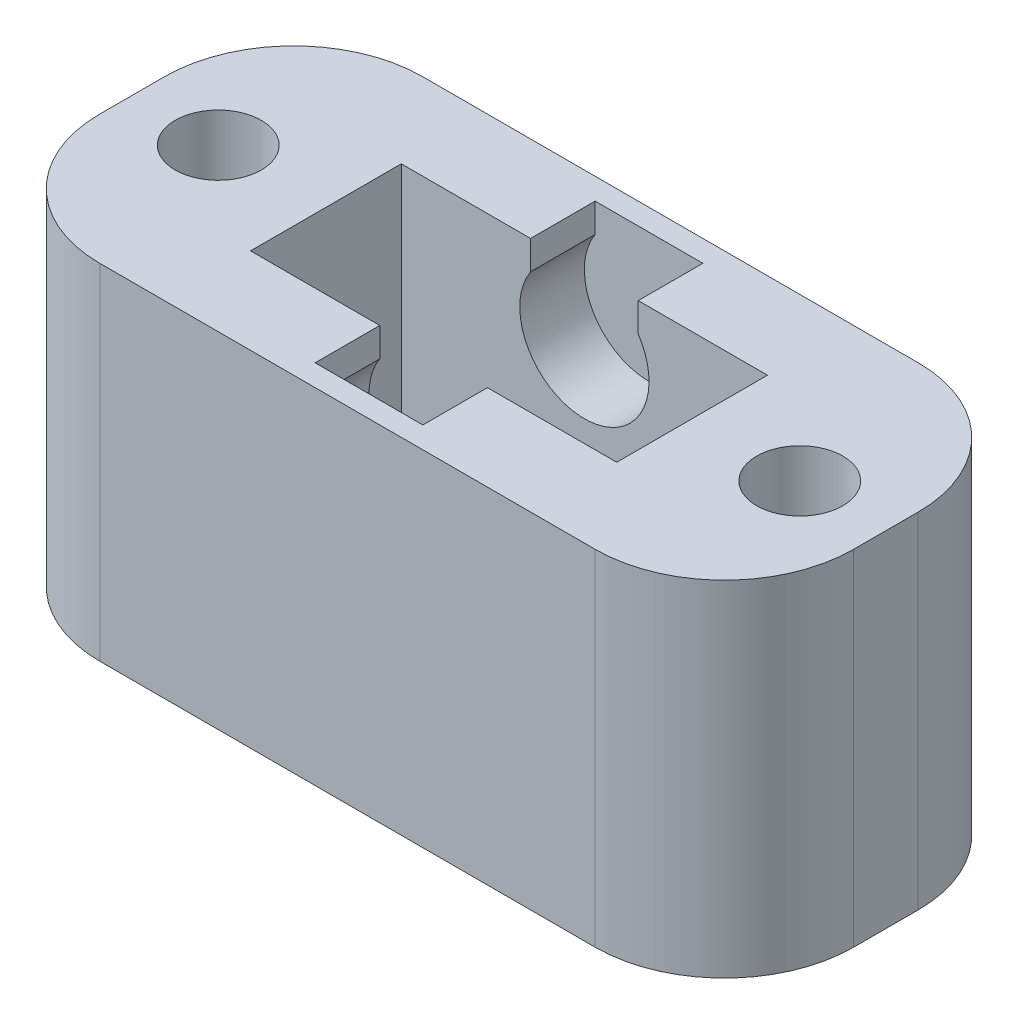
ISO-10303-21;
HEADER;
FILE_DESCRIPTION(('STEP AP214'),'2;1');
FILE_NAME('part.step','',(''),(''),'','','');
FILE_SCHEMA(('AUTOMOTIVE_DESIGN { 1 0 10303 214 1 1 1 1 }'));
ENDSEC;
DATA;
#1=APPLICATION_CONTEXT('core data for automotive mechanical design processes');
#2=APPLICATION_PROTOCOL_DEFINITION('international standard','automotive_design',2000,#1);
#3=PRODUCT_CONTEXT('',#1,'mechanical');
#4=PRODUCT('Part','Part','',(#3));
#5=PRODUCT_RELATED_PRODUCT_CATEGORY('part','',(#4));
#6=PRODUCT_DEFINITION_FORMATION('','',#4);
#7=PRODUCT_DEFINITION_CONTEXT('part definition',#1,'design');
#8=PRODUCT_DEFINITION('design','',#6,#7);
#9=PRODUCT_DEFINITION_SHAPE('','',#8);
#10=(LENGTH_UNIT() NAMED_UNIT(*) SI_UNIT(.MILLI.,.METRE.));
#11=(NAMED_UNIT(*) PLANE_ANGLE_UNIT() SI_UNIT($,.RADIAN.));
#12=(NAMED_UNIT(*) SI_UNIT($,.STERADIAN.) SOLID_ANGLE_UNIT());
#13=UNCERTAINTY_MEASURE_WITH_UNIT(LENGTH_MEASURE(1.E-05),#10,'distance_accuracy_value','');
#14=(GEOMETRIC_REPRESENTATION_CONTEXT(3) GLOBAL_UNCERTAINTY_ASSIGNED_CONTEXT((#13)) GLOBAL_UNIT_ASSIGNED_CONTEXT((#10,
#11,#12)) REPRESENTATION_CONTEXT('',''));
#15=CARTESIAN_POINT('',(0.,0.,0.));
#16=DIRECTION('',(0.,0.,1.));
#17=DIRECTION('',(1.,0.,0.));
#18=AXIS2_PLACEMENT_3D('',#15,#16,#17);
#19=CARTESIAN_POINT('',(0.,8.,0.));
#20=DIRECTION('',(0.,-1.,0.));
#21=DIRECTION('',(0.,0.,-1.));
#22=AXIS2_PLACEMENT_3D('',#19,#20,#21);
#23=PLANE('',#22);
#24=DIRECTION('',(0.,0.,1.));
#25=VECTOR('',#24,1.);
#26=CARTESIAN_POINT('',(-8.75,8.,3.75));
#27=LINE('',#26,#25);
#28=CARTESIAN_POINT('',(-8.75,8.,-0.749999999999997));
#29=VERTEX_POINT('',#28);
#30=CARTESIAN_POINT('',(-8.75,8.,0.75));
#31=VERTEX_POINT('',#30);
#32=EDGE_CURVE('E336',#29,#31,#27,.T.);
#33=ORIENTED_EDGE('',*,*,#32,.T.);
#34=CARTESIAN_POINT('',(-5.75,8.,0.749999999999999));
#35=DIRECTION('',(0.,-1.,0.));
#36=DIRECTION('',(0.,0.,-1.));
#37=AXIS2_PLACEMENT_3D('',#34,#35,#36);
#38=CIRCLE('',#37,3.);
#39=CARTESIAN_POINT('',(-5.75,8.,3.75));
#40=VERTEX_POINT('',#39);
#41=EDGE_CURVE('E393',#31,#40,#38,.F.);
#42=ORIENTED_EDGE('',*,*,#41,.T.);
#43=DIRECTION('',(1.,0.,0.));
#44=VECTOR('',#43,1.);
#45=CARTESIAN_POINT('',(-8.75,8.,3.75));
#46=LINE('',#45,#44);
#47=CARTESIAN_POINT('',(5.75,8.,3.75));
#48=VERTEX_POINT('',#47);
#49=EDGE_CURVE('E340',#40,#48,#46,.T.);
#50=ORIENTED_EDGE('',*,*,#49,.T.);
#51=CARTESIAN_POINT('',(5.75,8.,0.749999999999998));
#52=DIRECTION('',(0.,-1.,0.));
#53=DIRECTION('',(0.,0.,-1.));
#54=AXIS2_PLACEMENT_3D('',#51,#52,#53);
#55=CIRCLE('',#54,3.);
#56=CARTESIAN_POINT('',(8.75,8.,0.749999999999998));
#57=VERTEX_POINT('',#56);
#58=EDGE_CURVE('E384',#48,#57,#55,.F.);
#59=ORIENTED_EDGE('',*,*,#58,.T.);
#60=DIRECTION('',(0.,0.,-1.));
#61=VECTOR('',#60,1.);
#62=CARTESIAN_POINT('',(8.75,8.,3.75));
#63=LINE('',#62,#61);
#64=CARTESIAN_POINT('',(8.75,8.,-0.75));
#65=VERTEX_POINT('',#64);
#66=EDGE_CURVE('E327',#57,#65,#63,.T.);
#67=ORIENTED_EDGE('',*,*,#66,.T.);
#68=CARTESIAN_POINT('',(5.75,8.,-0.75));
#69=DIRECTION('',(0.,-1.,0.));
#70=DIRECTION('',(0.,0.,-1.));
#71=AXIS2_PLACEMENT_3D('',#68,#69,#70);
#72=CIRCLE('',#71,3.);
#73=CARTESIAN_POINT('',(5.75,8.,-3.75));
#74=VERTEX_POINT('',#73);
#75=EDGE_CURVE('E387',#65,#74,#72,.F.);
#76=ORIENTED_EDGE('',*,*,#75,.T.);
#77=DIRECTION('',(-1.,0.,0.));
#78=VECTOR('',#77,1.);
#79=CARTESIAN_POINT('',(-8.75,8.,-3.75));
#80=LINE('',#79,#78);
#81=CARTESIAN_POINT('',(-5.75,8.,-3.75));
#82=VERTEX_POINT('',#81);
#83=EDGE_CURVE('E331',#74,#82,#80,.T.);
#84=ORIENTED_EDGE('',*,*,#83,.T.);
#85=CARTESIAN_POINT('',(-5.75,8.,-0.749999999999998));
#86=DIRECTION('',(0.,-1.,0.));
#87=DIRECTION('',(0.,0.,-1.));
#88=AXIS2_PLACEMENT_3D('',#85,#86,#87);
#89=CIRCLE('',#88,3.);
#90=EDGE_CURVE('E390',#82,#29,#89,.F.);
#91=ORIENTED_EDGE('',*,*,#90,.T.);
#92=EDGE_LOOP('',(#33,#42,#50,#59,#67,#76,#84,#91));
#93=FACE_BOUND('',#92,.T.);
#94=CARTESIAN_POINT('',(-6.75,8.,0.));
#95=DIRECTION('',(0.,1.,0.));
#96=DIRECTION('',(0.,0.,1.));
#97=AXIS2_PLACEMENT_3D('',#94,#95,#96);
#98=CIRCLE('',#97,0.999999999999999);
#99=CARTESIAN_POINT('',(-6.75,8.,0.999999999999999));
#100=VERTEX_POINT('',#99);
#101=EDGE_CURVE('E272',#100,#100,#98,.T.);
#102=ORIENTED_EDGE('',*,*,#101,.F.);
#103=EDGE_LOOP('',(#102));
#104=FACE_BOUND('',#103,.T.);
#105=CARTESIAN_POINT('',(6.75,8.,0.));
#106=DIRECTION('',(0.,1.,0.));
#107=DIRECTION('',(0.,0.,-1.));
#108=AXIS2_PLACEMENT_3D('',#105,#106,#107);
#109=CIRCLE('',#108,0.999999999999999);
#110=CARTESIAN_POINT('',(6.75,8.,-1.));
#111=VERTEX_POINT('',#110);
#112=EDGE_CURVE('E264',#111,#111,#109,.T.);
#113=ORIENTED_EDGE('',*,*,#112,.F.);
#114=EDGE_LOOP('',(#113));
#115=FACE_BOUND('',#114,.T.);
#116=DIRECTION('',(0.,0.,1.));
#117=VECTOR('',#116,1.);
#118=CARTESIAN_POINT('',(-1.25,8.,-3.25));
#119=LINE('',#118,#117);
#120=CARTESIAN_POINT('',(-1.25,8.,-3.25));
#121=VERTEX_POINT('',#120);
#122=CARTESIAN_POINT('',(-1.25,8.,-1.75));
#123=VERTEX_POINT('',#122);
#124=EDGE_CURVE('E221',#121,#123,#119,.T.);
#125=ORIENTED_EDGE('',*,*,#124,.F.);
#126=DIRECTION('',(1.,0.,0.));
#127=VECTOR('',#126,1.);
#128=CARTESIAN_POINT('',(0.,8.,-3.25));
#129=LINE('',#128,#127);
#130=CARTESIAN_POINT('',(1.25,8.,-3.25));
#131=VERTEX_POINT('',#130);
#132=EDGE_CURVE('E203',#121,#131,#129,.T.);
#133=ORIENTED_EDGE('',*,*,#132,.T.);
#134=DIRECTION('',(0.,0.,1.));
#135=VECTOR('',#134,1.);
#136=CARTESIAN_POINT('',(1.25,8.,-3.25));
#137=LINE('',#136,#135);
#138=CARTESIAN_POINT('',(1.25,8.,-1.75));
#139=VERTEX_POINT('',#138);
#140=EDGE_CURVE('E188',#131,#139,#137,.T.);
#141=ORIENTED_EDGE('',*,*,#140,.T.);
#142=DIRECTION('',(-1.,0.,0.));
#143=VECTOR('',#142,1.);
#144=CARTESIAN_POINT('',(-4.25,8.,-1.75));
#145=LINE('',#144,#143);
#146=CARTESIAN_POINT('',(4.25,8.,-1.75));
#147=VERTEX_POINT('',#146);
#148=EDGE_CURVE('E285',#147,#139,#145,.T.);
#149=ORIENTED_EDGE('',*,*,#148,.F.);
#150=DIRECTION('',(0.,0.,-1.));
#151=VECTOR('',#150,1.);
#152=CARTESIAN_POINT('',(4.25,8.,1.75));
#153=LINE('',#152,#151);
#154=CARTESIAN_POINT('',(4.25,8.,1.75));
#155=VERTEX_POINT('',#154);
#156=EDGE_CURVE('E280',#155,#147,#153,.T.);
#157=ORIENTED_EDGE('',*,*,#156,.F.);
#158=DIRECTION('',(1.,0.,0.));
#159=VECTOR('',#158,1.);
#160=CARTESIAN_POINT('',(-4.25,8.,1.75));
#161=LINE('',#160,#159);
#162=CARTESIAN_POINT('',(1.25,8.,1.75));
#163=VERTEX_POINT('',#162);
#164=EDGE_CURVE('E293',#163,#155,#161,.T.);
#165=ORIENTED_EDGE('',*,*,#164,.F.);
#166=DIRECTION('',(0.,0.,-1.));
#167=VECTOR('',#166,1.);
#168=CARTESIAN_POINT('',(1.25,8.,3.25));
#169=LINE('',#168,#167);
#170=CARTESIAN_POINT('',(1.25,8.,3.25));
#171=VERTEX_POINT('',#170);
#172=EDGE_CURVE('E255',#171,#163,#169,.T.);
#173=ORIENTED_EDGE('',*,*,#172,.F.);
#174=DIRECTION('',(1.,0.,0.));
#175=VECTOR('',#174,1.);
#176=CARTESIAN_POINT('',(0.,8.,3.25));
#177=LINE('',#176,#175);
#178=CARTESIAN_POINT('',(-1.25,8.,3.25));
#179=VERTEX_POINT('',#178);
#180=EDGE_CURVE('E235',#179,#171,#177,.T.);
#181=ORIENTED_EDGE('',*,*,#180,.F.);
#182=DIRECTION('',(0.,0.,-1.));
#183=VECTOR('',#182,1.);
#184=CARTESIAN_POINT('',(-1.25,8.,3.25));
#185=LINE('',#184,#183);
#186=CARTESIAN_POINT('',(-1.25,8.,1.75));
#187=VERTEX_POINT('',#186);
#188=EDGE_CURVE('E258',#179,#187,#185,.T.);
#189=ORIENTED_EDGE('',*,*,#188,.T.);
#190=CARTESIAN_POINT('',(-4.25,8.,1.75));
#191=VERTEX_POINT('',#190);
#192=EDGE_CURVE('E294',#191,#187,#161,.T.);
#193=ORIENTED_EDGE('',*,*,#192,.F.);
#194=DIRECTION('',(0.,0.,1.));
#195=VECTOR('',#194,1.);
#196=CARTESIAN_POINT('',(-4.25,8.,1.75));
#197=LINE('',#196,#195);
#198=CARTESIAN_POINT('',(-4.25,8.,-1.75));
#199=VERTEX_POINT('',#198);
#200=EDGE_CURVE('E289',#199,#191,#197,.T.);
#201=ORIENTED_EDGE('',*,*,#200,.F.);
#202=EDGE_CURVE('E283',#123,#199,#145,.T.);
#203=ORIENTED_EDGE('',*,*,#202,.F.);
#204=EDGE_LOOP('',(#125,#133,#141,#149,#157,#165,#173,#181,#189,#193,#201,#203));
#205=FACE_BOUND('',#204,.T.);
#206=ADVANCED_FACE('F43',(#93,#104,#115,#205),#23,.F.);
#207=CARTESIAN_POINT('',(-4.25,8.,-1.75));
#208=DIRECTION('',(0.,0.,1.));
#209=DIRECTION('',(1.,0.,0.));
#210=AXIS2_PLACEMENT_3D('',#207,#208,#209);
#211=PLANE('',#210);
#212=CARTESIAN_POINT('',(0.,6.5,-1.75));
#213=DIRECTION('',(0.,0.,-1.));
#214=DIRECTION('',(-1.,0.,0.));
#215=AXIS2_PLACEMENT_3D('',#212,#213,#214);
#216=CIRCLE('',#215,1.5);
#217=CARTESIAN_POINT('',(1.25,7.32915619758885,-1.75));
#218=VERTEX_POINT('',#217);
#219=CARTESIAN_POINT('',(-1.25,7.32915619758885,-1.75));
#220=VERTEX_POINT('',#219);
#221=EDGE_CURVE('E59',#218,#220,#216,.T.);
#222=ORIENTED_EDGE('',*,*,#221,.T.);
#223=DIRECTION('',(0.,1.,0.));
#224=VECTOR('',#223,1.);
#225=CARTESIAN_POINT('',(-1.25,0.,-1.75));
#226=LINE('',#225,#224);
#227=EDGE_CURVE('E198',#220,#123,#226,.T.);
#228=ORIENTED_EDGE('',*,*,#227,.T.);
#229=ORIENTED_EDGE('',*,*,#202,.T.);
#230=DIRECTION('',(0.,-1.,0.));
#231=VECTOR('',#230,1.);
#232=CARTESIAN_POINT('',(-4.25,8.,-1.75));
#233=LINE('',#232,#231);
#234=CARTESIAN_POINT('',(-4.25,0.,-1.75));
#235=VERTEX_POINT('',#234);
#236=EDGE_CURVE('E319',#199,#235,#233,.T.);
#237=ORIENTED_EDGE('',*,*,#236,.T.);
#238=DIRECTION('',(-1.,0.,0.));
#239=VECTOR('',#238,1.);
#240=CARTESIAN_POINT('',(-4.25,0.,-1.75));
#241=LINE('',#240,#239);
#242=CARTESIAN_POINT('',(4.25,0.,-1.75));
#243=VERTEX_POINT('',#242);
#244=EDGE_CURVE('E302',#243,#235,#241,.T.);
#245=ORIENTED_EDGE('',*,*,#244,.F.);
#246=DIRECTION('',(0.,-1.,0.));
#247=VECTOR('',#246,1.);
#248=CARTESIAN_POINT('',(4.25,8.,-1.75));
#249=LINE('',#248,#247);
#250=EDGE_CURVE('E322',#147,#243,#249,.T.);
#251=ORIENTED_EDGE('',*,*,#250,.F.);
#252=ORIENTED_EDGE('',*,*,#148,.T.);
#253=DIRECTION('',(0.,1.,0.));
#254=VECTOR('',#253,1.);
#255=CARTESIAN_POINT('',(1.25,0.,-1.75));
#256=LINE('',#255,#254);
#257=EDGE_CURVE('E212',#218,#139,#256,.T.);
#258=ORIENTED_EDGE('',*,*,#257,.F.);
#259=EDGE_LOOP('',(#222,#228,#229,#237,#245,#251,#252,#258));
#260=FACE_BOUND('',#259,.T.);
#261=ADVANCED_FACE('F453',(#260),#211,.T.);
#262=CARTESIAN_POINT('',(-4.25,8.,1.75));
#263=DIRECTION('',(0.,0.,-1.));
#264=DIRECTION('',(-1.,0.,0.));
#265=AXIS2_PLACEMENT_3D('',#262,#263,#264);
#266=PLANE('',#265);
#267=CARTESIAN_POINT('',(0.,6.5,1.75));
#268=DIRECTION('',(0.,0.,-1.));
#269=DIRECTION('',(-1.,0.,0.));
#270=AXIS2_PLACEMENT_3D('',#267,#268,#269);
#271=CIRCLE('',#270,1.5);
#272=CARTESIAN_POINT('',(1.25,7.32915619758885,1.75));
#273=VERTEX_POINT('',#272);
#274=CARTESIAN_POINT('',(-1.25,7.32915619758885,1.75));
#275=VERTEX_POINT('',#274);
#276=EDGE_CURVE('E67',#273,#275,#271,.T.);
#277=ORIENTED_EDGE('',*,*,#276,.F.);
#278=DIRECTION('',(0.,1.,0.));
#279=VECTOR('',#278,1.);
#280=CARTESIAN_POINT('',(1.25,0.,1.75));
#281=LINE('',#280,#279);
#282=EDGE_CURVE('E231',#273,#163,#281,.T.);
#283=ORIENTED_EDGE('',*,*,#282,.T.);
#284=ORIENTED_EDGE('',*,*,#164,.T.);
#285=DIRECTION('',(0.,-1.,0.));
#286=VECTOR('',#285,1.);
#287=CARTESIAN_POINT('',(4.25,8.,1.75));
#288=LINE('',#287,#286);
#289=CARTESIAN_POINT('',(4.25,0.,1.75));
#290=VERTEX_POINT('',#289);
#291=EDGE_CURVE('E298',#155,#290,#288,.T.);
#292=ORIENTED_EDGE('',*,*,#291,.T.);
#293=DIRECTION('',(1.,0.,0.));
#294=VECTOR('',#293,1.);
#295=CARTESIAN_POINT('',(-4.25,0.,1.75));
#296=LINE('',#295,#294);
#297=CARTESIAN_POINT('',(-4.25,0.,1.75));
#298=VERTEX_POINT('',#297);
#299=EDGE_CURVE('E284',#298,#290,#296,.T.);
#300=ORIENTED_EDGE('',*,*,#299,.F.);
#301=DIRECTION('',(0.,-1.,0.));
#302=VECTOR('',#301,1.);
#303=CARTESIAN_POINT('',(-4.25,8.,1.75));
#304=LINE('',#303,#302);
#305=EDGE_CURVE('E316',#191,#298,#304,.T.);
#306=ORIENTED_EDGE('',*,*,#305,.F.);
#307=ORIENTED_EDGE('',*,*,#192,.T.);
#308=DIRECTION('',(0.,1.,0.));
#309=VECTOR('',#308,1.);
#310=CARTESIAN_POINT('',(-1.25,0.,1.75));
#311=LINE('',#310,#309);
#312=EDGE_CURVE('E245',#275,#187,#311,.T.);
#313=ORIENTED_EDGE('',*,*,#312,.F.);
#314=EDGE_LOOP('',(#277,#283,#284,#292,#300,#306,#307,#313));
#315=FACE_BOUND('',#314,.T.);
#316=ADVANCED_FACE('F458',(#315),#266,.T.);
#317=CARTESIAN_POINT('',(0.,0.,0.));
#318=DIRECTION('',(0.,-1.,0.));
#319=DIRECTION('',(0.,0.,-1.));
#320=AXIS2_PLACEMENT_3D('',#317,#318,#319);
#321=PLANE('',#320);
#322=CARTESIAN_POINT('',(-6.75,0.,0.));
#323=DIRECTION('',(0.,1.,0.));
#324=DIRECTION('',(0.,0.,1.));
#325=AXIS2_PLACEMENT_3D('',#322,#323,#324);
#326=CIRCLE('',#325,0.999999999999999);
#327=CARTESIAN_POINT('',(-6.75,0.,0.999999999999999));
#328=VERTEX_POINT('',#327);
#329=EDGE_CURVE('E268',#328,#328,#326,.T.);
#330=ORIENTED_EDGE('',*,*,#329,.T.);
#331=EDGE_LOOP('',(#330));
#332=FACE_BOUND('',#331,.T.);
#333=DIRECTION('',(1.,0.,0.));
#334=VECTOR('',#333,1.);
#335=CARTESIAN_POINT('',(-8.75,0.,3.75));
#336=LINE('',#335,#334);
#337=CARTESIAN_POINT('',(-5.75,0.,3.75));
#338=VERTEX_POINT('',#337);
#339=CARTESIAN_POINT('',(5.75,0.,3.75));
#340=VERTEX_POINT('',#339);
#341=EDGE_CURVE('E332',#338,#340,#336,.T.);
#342=ORIENTED_EDGE('',*,*,#341,.F.);
#343=CARTESIAN_POINT('',(-5.75,0.,0.749999999999999));
#344=DIRECTION('',(0.,-1.,0.));
#345=DIRECTION('',(0.,0.,-1.));
#346=AXIS2_PLACEMENT_3D('',#343,#344,#345);
#347=CIRCLE('',#346,3.);
#348=CARTESIAN_POINT('',(-8.75,0.,0.75));
#349=VERTEX_POINT('',#348);
#350=EDGE_CURVE('E374',#338,#349,#347,.T.);
#351=ORIENTED_EDGE('',*,*,#350,.T.);
#352=DIRECTION('',(0.,0.,1.));
#353=VECTOR('',#352,1.);
#354=CARTESIAN_POINT('',(-8.75,0.,3.75));
#355=LINE('',#354,#353);
#356=CARTESIAN_POINT('',(-8.75,0.,-0.749999999999997));
#357=VERTEX_POINT('',#356);
#358=EDGE_CURVE('E352',#357,#349,#355,.T.);
#359=ORIENTED_EDGE('',*,*,#358,.F.);
#360=CARTESIAN_POINT('',(-5.75,0.,-0.749999999999998));
#361=DIRECTION('',(0.,-1.,0.));
#362=DIRECTION('',(0.,0.,-1.));
#363=AXIS2_PLACEMENT_3D('',#360,#361,#362);
#364=CIRCLE('',#363,3.);
#365=CARTESIAN_POINT('',(-5.75,0.,-3.75));
#366=VERTEX_POINT('',#365);
#367=EDGE_CURVE('E371',#357,#366,#364,.T.);
#368=ORIENTED_EDGE('',*,*,#367,.T.);
#369=DIRECTION('',(-1.,0.,0.));
#370=VECTOR('',#369,1.);
#371=CARTESIAN_POINT('',(-8.75,0.,-3.75));
#372=LINE('',#371,#370);
#373=CARTESIAN_POINT('',(5.75,0.,-3.75));
#374=VERTEX_POINT('',#373);
#375=EDGE_CURVE('E348',#374,#366,#372,.T.);
#376=ORIENTED_EDGE('',*,*,#375,.F.);
#377=CARTESIAN_POINT('',(5.75,0.,-0.75));
#378=DIRECTION('',(0.,-1.,0.));
#379=DIRECTION('',(0.,0.,-1.));
#380=AXIS2_PLACEMENT_3D('',#377,#378,#379);
#381=CIRCLE('',#380,3.);
#382=CARTESIAN_POINT('',(8.75,0.,-0.75));
#383=VERTEX_POINT('',#382);
#384=EDGE_CURVE('E368',#374,#383,#381,.T.);
#385=ORIENTED_EDGE('',*,*,#384,.T.);
#386=DIRECTION('',(0.,0.,-1.));
#387=VECTOR('',#386,1.);
#388=CARTESIAN_POINT('',(8.75,0.,3.75));
#389=LINE('',#388,#387);
#390=CARTESIAN_POINT('',(8.75,0.,0.749999999999998));
#391=VERTEX_POINT('',#390);
#392=EDGE_CURVE('E326',#391,#383,#389,.T.);
#393=ORIENTED_EDGE('',*,*,#392,.F.);
#394=CARTESIAN_POINT('',(5.75,0.,0.749999999999998));
#395=DIRECTION('',(0.,-1.,0.));
#396=DIRECTION('',(0.,0.,-1.));
#397=AXIS2_PLACEMENT_3D('',#394,#395,#396);
#398=CIRCLE('',#397,3.);
#399=EDGE_CURVE('E365',#391,#340,#398,.T.);
#400=ORIENTED_EDGE('',*,*,#399,.T.);
#401=EDGE_LOOP('',(#342,#351,#359,#368,#376,#385,#393,#400));
#402=FACE_BOUND('',#401,.T.);
#403=ORIENTED_EDGE('',*,*,#299,.T.);
#404=DIRECTION('',(0.,0.,-1.));
#405=VECTOR('',#404,1.);
#406=CARTESIAN_POINT('',(4.25,0.,1.75));
#407=LINE('',#406,#405);
#408=EDGE_CURVE('E276',#290,#243,#407,.T.);
#409=ORIENTED_EDGE('',*,*,#408,.T.);
#410=ORIENTED_EDGE('',*,*,#244,.T.);
#411=DIRECTION('',(0.,0.,1.));
#412=VECTOR('',#411,1.);
#413=CARTESIAN_POINT('',(-4.25,0.,1.75));
#414=LINE('',#413,#412);
#415=EDGE_CURVE('E306',#235,#298,#414,.T.);
#416=ORIENTED_EDGE('',*,*,#415,.T.);
#417=EDGE_LOOP('',(#403,#409,#410,#416));
#418=FACE_BOUND('',#417,.T.);
#419=CARTESIAN_POINT('',(6.75,0.,0.));
#420=DIRECTION('',(0.,1.,0.));
#421=DIRECTION('',(0.,0.,-1.));
#422=AXIS2_PLACEMENT_3D('',#419,#420,#421);
#423=CIRCLE('',#422,0.999999999999999);
#424=CARTESIAN_POINT('',(6.75,0.,-1.));
#425=VERTEX_POINT('',#424);
#426=EDGE_CURVE('E254',#425,#425,#423,.T.);
#427=ORIENTED_EDGE('',*,*,#426,.T.);
#428=EDGE_LOOP('',(#427));
#429=FACE_BOUND('',#428,.T.);
#430=ADVANCED_FACE('F414',(#332,#402,#418,#429),#321,.T.);
#431=CARTESIAN_POINT('',(8.75,8.,3.75));
#432=DIRECTION('',(-1.,0.,0.));
#433=DIRECTION('',(0.,0.,1.));
#434=AXIS2_PLACEMENT_3D('',#431,#432,#433);
#435=PLANE('',#434);
#436=ORIENTED_EDGE('',*,*,#392,.T.);
#437=DIRECTION('',(0.,-1.,0.));
#438=VECTOR('',#437,1.);
#439=CARTESIAN_POINT('',(8.75,8.,-0.75));
#440=LINE('',#439,#438);
#441=EDGE_CURVE('E11',#383,#65,#440,.F.);
#442=ORIENTED_EDGE('',*,*,#441,.T.);
#443=ORIENTED_EDGE('',*,*,#66,.F.);
#444=DIRECTION('',(0.,-1.,0.));
#445=VECTOR('',#444,1.);
#446=CARTESIAN_POINT('',(8.75,8.,0.749999999999998));
#447=LINE('',#446,#445);
#448=EDGE_CURVE('E52',#57,#391,#447,.T.);
#449=ORIENTED_EDGE('',*,*,#448,.T.);
#450=EDGE_LOOP('',(#436,#442,#443,#449));
#451=FACE_BOUND('',#450,.T.);
#452=ADVANCED_FACE('F408',(#451),#435,.F.);
#453=CARTESIAN_POINT('',(-8.75,8.,-3.75));
#454=DIRECTION('',(0.,0.,1.));
#455=DIRECTION('',(1.,0.,0.));
#456=AXIS2_PLACEMENT_3D('',#453,#454,#455);
#457=PLANE('',#456);
#458=ORIENTED_EDGE('',*,*,#375,.T.);
#459=DIRECTION('',(0.,-1.,0.));
#460=VECTOR('',#459,1.);
#461=CARTESIAN_POINT('',(-5.75,8.,-3.75));
#462=LINE('',#461,#460);
#463=EDGE_CURVE('E400',#366,#82,#462,.F.);
#464=ORIENTED_EDGE('',*,*,#463,.T.);
#465=ORIENTED_EDGE('',*,*,#83,.F.);
#466=DIRECTION('',(0.,-1.,0.));
#467=VECTOR('',#466,1.);
#468=CARTESIAN_POINT('',(5.75,8.,-3.75));
#469=LINE('',#468,#467);
#470=EDGE_CURVE('E396',#74,#374,#469,.T.);
#471=ORIENTED_EDGE('',*,*,#470,.T.);
#472=EDGE_LOOP('',(#458,#464,#465,#471));
#473=FACE_BOUND('',#472,.T.);
#474=ADVANCED_FACE('F423',(#473),#457,.F.);
#475=CARTESIAN_POINT('',(-8.75,8.,3.75));
#476=DIRECTION('',(1.,0.,0.));
#477=DIRECTION('',(0.,0.,-1.));
#478=AXIS2_PLACEMENT_3D('',#475,#476,#477);
#479=PLANE('',#478);
#480=ORIENTED_EDGE('',*,*,#358,.T.);
#481=DIRECTION('',(0.,-1.,0.));
#482=VECTOR('',#481,1.);
#483=CARTESIAN_POINT('',(-8.75,8.,0.75));
#484=LINE('',#483,#482);
#485=EDGE_CURVE('E381',#349,#31,#484,.F.);
#486=ORIENTED_EDGE('',*,*,#485,.T.);
#487=ORIENTED_EDGE('',*,*,#32,.F.);
#488=DIRECTION('',(0.,-1.,0.));
#489=VECTOR('',#488,1.);
#490=CARTESIAN_POINT('',(-8.75,8.,-0.749999999999997));
#491=LINE('',#490,#489);
#492=EDGE_CURVE('E377',#29,#357,#491,.T.);
#493=ORIENTED_EDGE('',*,*,#492,.T.);
#494=EDGE_LOOP('',(#480,#486,#487,#493));
#495=FACE_BOUND('',#494,.T.);
#496=ADVANCED_FACE('F434',(#495),#479,.F.);
#497=CARTESIAN_POINT('',(-8.75,8.,3.75));
#498=DIRECTION('',(0.,0.,-1.));
#499=DIRECTION('',(-1.,0.,0.));
#500=AXIS2_PLACEMENT_3D('',#497,#498,#499);
#501=PLANE('',#500);
#502=ORIENTED_EDGE('',*,*,#49,.F.);
#503=DIRECTION('',(0.,-1.,0.));
#504=VECTOR('',#503,1.);
#505=CARTESIAN_POINT('',(-5.75,8.,3.75));
#506=LINE('',#505,#504);
#507=EDGE_CURVE('E361',#40,#338,#506,.T.);
#508=ORIENTED_EDGE('',*,*,#507,.T.);
#509=ORIENTED_EDGE('',*,*,#341,.T.);
#510=DIRECTION('',(0.,-1.,0.));
#511=VECTOR('',#510,1.);
#512=CARTESIAN_POINT('',(5.75,8.,3.75));
#513=LINE('',#512,#511);
#514=EDGE_CURVE('E344',#340,#48,#513,.F.);
#515=ORIENTED_EDGE('',*,*,#514,.T.);
#516=EDGE_LOOP('',(#502,#508,#509,#515));
#517=FACE_BOUND('',#516,.T.);
#518=ADVANCED_FACE('F442',(#517),#501,.F.);
#519=CARTESIAN_POINT('',(4.25,8.,1.75));
#520=DIRECTION('',(-1.,0.,0.));
#521=DIRECTION('',(0.,0.,1.));
#522=AXIS2_PLACEMENT_3D('',#519,#520,#521);
#523=PLANE('',#522);
#524=ORIENTED_EDGE('',*,*,#408,.F.);
#525=ORIENTED_EDGE('',*,*,#291,.F.);
#526=ORIENTED_EDGE('',*,*,#156,.T.);
#527=ORIENTED_EDGE('',*,*,#250,.T.);
#528=EDGE_LOOP('',(#524,#525,#526,#527));
#529=FACE_BOUND('',#528,.T.);
#530=ADVANCED_FACE('F463',(#529),#523,.T.);
#531=CARTESIAN_POINT('',(-4.25,8.,1.75));
#532=DIRECTION('',(1.,0.,0.));
#533=DIRECTION('',(0.,0.,-1.));
#534=AXIS2_PLACEMENT_3D('',#531,#532,#533);
#535=PLANE('',#534);
#536=ORIENTED_EDGE('',*,*,#415,.F.);
#537=ORIENTED_EDGE('',*,*,#236,.F.);
#538=ORIENTED_EDGE('',*,*,#200,.T.);
#539=ORIENTED_EDGE('',*,*,#305,.T.);
#540=EDGE_LOOP('',(#536,#537,#538,#539));
#541=FACE_BOUND('',#540,.T.);
#542=ADVANCED_FACE('F609',(#541),#535,.T.);
#543=CARTESIAN_POINT('',(-6.75,8.,0.));
#544=DIRECTION('',(0.,-1.,0.));
#545=DIRECTION('',(0.,0.,-1.));
#546=AXIS2_PLACEMENT_3D('',#543,#544,#545);
#547=CYLINDRICAL_SURFACE('',#546,0.999999999999999);
#548=ORIENTED_EDGE('',*,*,#101,.T.);
#549=EDGE_LOOP('',(#548));
#550=FACE_BOUND('',#549,.T.);
#551=ORIENTED_EDGE('',*,*,#329,.F.);
#552=EDGE_LOOP('',(#551));
#553=FACE_BOUND('',#552,.T.);
#554=ADVANCED_FACE('F606',(#550,#553),#547,.F.);
#555=CARTESIAN_POINT('',(6.75,8.,0.));
#556=DIRECTION('',(0.,-1.,0.));
#557=DIRECTION('',(0.,0.,-1.));
#558=AXIS2_PLACEMENT_3D('',#555,#556,#557);
#559=CYLINDRICAL_SURFACE('',#558,0.999999999999999);
#560=ORIENTED_EDGE('',*,*,#112,.T.);
#561=EDGE_LOOP('',(#560));
#562=FACE_BOUND('',#561,.T.);
#563=ORIENTED_EDGE('',*,*,#426,.F.);
#564=EDGE_LOOP('',(#563));
#565=FACE_BOUND('',#564,.T.);
#566=ADVANCED_FACE('F477',(#562,#565),#559,.F.);
#567=CARTESIAN_POINT('',(-5.75,8.,0.749999999999999));
#568=DIRECTION('',(0.,-1.,0.));
#569=DIRECTION('',(0.,0.,-1.));
#570=AXIS2_PLACEMENT_3D('',#567,#568,#569);
#571=CYLINDRICAL_SURFACE('',#570,3.);
#572=ORIENTED_EDGE('',*,*,#41,.F.);
#573=ORIENTED_EDGE('',*,*,#485,.F.);
#574=ORIENTED_EDGE('',*,*,#350,.F.);
#575=ORIENTED_EDGE('',*,*,#507,.F.);
#576=EDGE_LOOP('',(#572,#573,#574,#575));
#577=FACE_BOUND('',#576,.T.);
#578=ADVANCED_FACE('F439',(#577),#571,.T.);
#579=CARTESIAN_POINT('',(-5.75,8.,-0.749999999999998));
#580=DIRECTION('',(0.,-1.,0.));
#581=DIRECTION('',(0.,0.,-1.));
#582=AXIS2_PLACEMENT_3D('',#579,#580,#581);
#583=CYLINDRICAL_SURFACE('',#582,3.);
#584=ORIENTED_EDGE('',*,*,#90,.F.);
#585=ORIENTED_EDGE('',*,*,#463,.F.);
#586=ORIENTED_EDGE('',*,*,#367,.F.);
#587=ORIENTED_EDGE('',*,*,#492,.F.);
#588=EDGE_LOOP('',(#584,#585,#586,#587));
#589=FACE_BOUND('',#588,.T.);
#590=ADVANCED_FACE('F431',(#589),#583,.T.);
#591=CARTESIAN_POINT('',(5.75,8.,-0.75));
#592=DIRECTION('',(0.,-1.,0.));
#593=DIRECTION('',(0.,0.,-1.));
#594=AXIS2_PLACEMENT_3D('',#591,#592,#593);
#595=CYLINDRICAL_SURFACE('',#594,3.);
#596=ORIENTED_EDGE('',*,*,#75,.F.);
#597=ORIENTED_EDGE('',*,*,#441,.F.);
#598=ORIENTED_EDGE('',*,*,#384,.F.);
#599=ORIENTED_EDGE('',*,*,#470,.F.);
#600=EDGE_LOOP('',(#596,#597,#598,#599));
#601=FACE_BOUND('',#600,.T.);
#602=ADVANCED_FACE('F420',(#601),#595,.T.);
#603=CARTESIAN_POINT('',(5.75,8.,0.749999999999998));
#604=DIRECTION('',(0.,-1.,0.));
#605=DIRECTION('',(0.,0.,-1.));
#606=AXIS2_PLACEMENT_3D('',#603,#604,#605);
#607=CYLINDRICAL_SURFACE('',#606,3.);
#608=ORIENTED_EDGE('',*,*,#58,.F.);
#609=ORIENTED_EDGE('',*,*,#514,.F.);
#610=ORIENTED_EDGE('',*,*,#399,.F.);
#611=ORIENTED_EDGE('',*,*,#448,.F.);
#612=EDGE_LOOP('',(#608,#609,#610,#611));
#613=FACE_BOUND('',#612,.T.);
#614=ADVANCED_FACE('F45',(#613),#607,.T.);
#615=CARTESIAN_POINT('',(0.,6.5,3.25));
#616=DIRECTION('',(0.,0.,-1.));
#617=DIRECTION('',(-1.,0.,0.));
#618=AXIS2_PLACEMENT_3D('',#615,#616,#617);
#619=CYLINDRICAL_SURFACE('',#618,1.5);
#620=ORIENTED_EDGE('',*,*,#276,.T.);
#621=DIRECTION('',(0.,0.,-1.));
#622=VECTOR('',#621,1.);
#623=CARTESIAN_POINT('',(-1.25,7.32915619758885,3.25));
#624=LINE('',#623,#622);
#625=CARTESIAN_POINT('',(-1.25,7.32915619758885,3.25));
#626=VERTEX_POINT('',#625);
#627=EDGE_CURVE('E242',#626,#275,#624,.T.);
#628=ORIENTED_EDGE('',*,*,#627,.F.);
#629=CARTESIAN_POINT('',(0.,6.5,3.25));
#630=DIRECTION('',(0.,0.,-1.));
#631=DIRECTION('',(-1.,0.,0.));
#632=AXIS2_PLACEMENT_3D('',#629,#630,#631);
#633=CIRCLE('',#632,1.5);
#634=CARTESIAN_POINT('',(1.25,7.32915619758885,3.25));
#635=VERTEX_POINT('',#634);
#636=EDGE_CURVE('E226',#635,#626,#633,.T.);
#637=ORIENTED_EDGE('',*,*,#636,.F.);
#638=DIRECTION('',(0.,0.,-1.));
#639=VECTOR('',#638,1.);
#640=CARTESIAN_POINT('',(1.25,7.32915619758885,3.25));
#641=LINE('',#640,#639);
#642=EDGE_CURVE('E251',#635,#273,#641,.T.);
#643=ORIENTED_EDGE('',*,*,#642,.T.);
#644=EDGE_LOOP('',(#620,#628,#637,#643));
#645=FACE_BOUND('',#644,.T.);
#646=ADVANCED_FACE('F445',(#645),#619,.F.);
#647=CARTESIAN_POINT('',(1.25,0.,3.25));
#648=DIRECTION('',(-1.,0.,0.));
#649=DIRECTION('',(0.,0.,1.));
#650=AXIS2_PLACEMENT_3D('',#647,#648,#649);
#651=PLANE('',#650);
#652=ORIENTED_EDGE('',*,*,#282,.F.);
#653=ORIENTED_EDGE('',*,*,#642,.F.);
#654=DIRECTION('',(0.,1.,0.));
#655=VECTOR('',#654,1.);
#656=CARTESIAN_POINT('',(1.25,0.,3.25));
#657=LINE('',#656,#655);
#658=EDGE_CURVE('E239',#635,#171,#657,.T.);
#659=ORIENTED_EDGE('',*,*,#658,.T.);
#660=ORIENTED_EDGE('',*,*,#172,.T.);
#661=EDGE_LOOP('',(#652,#653,#659,#660));
#662=FACE_BOUND('',#661,.T.);
#663=ADVANCED_FACE('F450',(#662),#651,.T.);
#664=CARTESIAN_POINT('',(-1.25,0.,3.25));
#665=DIRECTION('',(-1.,0.,0.));
#666=DIRECTION('',(0.,-1.,0.));
#667=AXIS2_PLACEMENT_3D('',#664,#665,#666);
#668=PLANE('',#667);
#669=ORIENTED_EDGE('',*,*,#312,.T.);
#670=ORIENTED_EDGE('',*,*,#188,.F.);
#671=DIRECTION('',(0.,1.,0.));
#672=VECTOR('',#671,1.);
#673=CARTESIAN_POINT('',(-1.25,0.,3.25));
#674=LINE('',#673,#672);
#675=EDGE_CURVE('E230',#626,#179,#674,.T.);
#676=ORIENTED_EDGE('',*,*,#675,.F.);
#677=ORIENTED_EDGE('',*,*,#627,.T.);
#678=EDGE_LOOP('',(#669,#670,#676,#677));
#679=FACE_BOUND('',#678,.T.);
#680=ADVANCED_FACE('F519',(#679),#668,.F.);
#681=CARTESIAN_POINT('',(0.,0.,3.25));
#682=DIRECTION('',(0.,0.,-1.));
#683=DIRECTION('',(-1.,0.,0.));
#684=AXIS2_PLACEMENT_3D('',#681,#682,#683);
#685=PLANE('',#684);
#686=ORIENTED_EDGE('',*,*,#636,.T.);
#687=ORIENTED_EDGE('',*,*,#675,.T.);
#688=ORIENTED_EDGE('',*,*,#180,.T.);
#689=ORIENTED_EDGE('',*,*,#658,.F.);
#690=EDGE_LOOP('',(#686,#687,#688,#689));
#691=FACE_BOUND('',#690,.T.);
#692=ADVANCED_FACE('F530',(#691),#685,.T.);
#693=CARTESIAN_POINT('',(0.,6.5,-3.25));
#694=DIRECTION('',(0.,0.,1.));
#695=DIRECTION('',(1.,0.,0.));
#696=AXIS2_PLACEMENT_3D('',#693,#694,#695);
#697=CYLINDRICAL_SURFACE('',#696,1.5);
#698=ORIENTED_EDGE('',*,*,#221,.F.);
#699=DIRECTION('',(0.,0.,1.));
#700=VECTOR('',#699,1.);
#701=CARTESIAN_POINT('',(1.25,7.32915619758885,-3.25));
#702=LINE('',#701,#700);
#703=CARTESIAN_POINT('',(1.25,7.32915619758885,-3.25));
#704=VERTEX_POINT('',#703);
#705=EDGE_CURVE('E179',#704,#218,#702,.T.);
#706=ORIENTED_EDGE('',*,*,#705,.F.);
#707=CARTESIAN_POINT('',(0.,6.5,-3.25));
#708=DIRECTION('',(0.,0.,-1.));
#709=DIRECTION('',(-1.,0.,0.));
#710=AXIS2_PLACEMENT_3D('',#707,#708,#709);
#711=CIRCLE('',#710,1.5);
#712=CARTESIAN_POINT('',(-1.25,7.32915619758885,-3.25));
#713=VERTEX_POINT('',#712);
#714=EDGE_CURVE('E182',#704,#713,#711,.T.);
#715=ORIENTED_EDGE('',*,*,#714,.T.);
#716=DIRECTION('',(0.,0.,1.));
#717=VECTOR('',#716,1.);
#718=CARTESIAN_POINT('',(-1.25,7.32915619758885,-3.25));
#719=LINE('',#718,#717);
#720=EDGE_CURVE('E218',#713,#220,#719,.T.);
#721=ORIENTED_EDGE('',*,*,#720,.T.);
#722=EDGE_LOOP('',(#698,#706,#715,#721));
#723=FACE_BOUND('',#722,.T.);
#724=ADVANCED_FACE('F181',(#723),#697,.F.);
#725=CARTESIAN_POINT('',(-1.25,0.,-3.25));
#726=DIRECTION('',(1.,0.,0.));
#727=DIRECTION('',(0.,1.,0.));
#728=AXIS2_PLACEMENT_3D('',#725,#726,#727);
#729=PLANE('',#728);
#730=ORIENTED_EDGE('',*,*,#227,.F.);
#731=ORIENTED_EDGE('',*,*,#720,.F.);
#732=DIRECTION('',(0.,1.,0.));
#733=VECTOR('',#732,1.);
#734=CARTESIAN_POINT('',(-1.25,0.,-3.25));
#735=LINE('',#734,#733);
#736=EDGE_CURVE('E189',#713,#121,#735,.T.);
#737=ORIENTED_EDGE('',*,*,#736,.T.);
#738=ORIENTED_EDGE('',*,*,#124,.T.);
#739=EDGE_LOOP('',(#730,#731,#737,#738));
#740=FACE_BOUND('',#739,.T.);
#741=ADVANCED_FACE('F563',(#740),#729,.T.);
#742=CARTESIAN_POINT('',(1.25,0.,-3.25));
#743=DIRECTION('',(1.,0.,0.));
#744=DIRECTION('',(0.,0.,-1.));
#745=AXIS2_PLACEMENT_3D('',#742,#743,#744);
#746=PLANE('',#745);
#747=ORIENTED_EDGE('',*,*,#257,.T.);
#748=ORIENTED_EDGE('',*,*,#140,.F.);
#749=DIRECTION('',(0.,1.,0.));
#750=VECTOR('',#749,1.);
#751=CARTESIAN_POINT('',(1.25,0.,-3.25));
#752=LINE('',#751,#750);
#753=EDGE_CURVE('E195',#704,#131,#752,.T.);
#754=ORIENTED_EDGE('',*,*,#753,.F.);
#755=ORIENTED_EDGE('',*,*,#705,.T.);
#756=EDGE_LOOP('',(#747,#748,#754,#755));
#757=FACE_BOUND('',#756,.T.);
#758=ADVANCED_FACE('F200',(#757),#746,.F.);
#759=CARTESIAN_POINT('',(0.,0.,-3.25));
#760=DIRECTION('',(0.,0.,1.));
#761=DIRECTION('',(-1.,0.,0.));
#762=AXIS2_PLACEMENT_3D('',#759,#760,#761);
#763=PLANE('',#762);
#764=ORIENTED_EDGE('',*,*,#714,.F.);
#765=ORIENTED_EDGE('',*,*,#753,.T.);
#766=ORIENTED_EDGE('',*,*,#132,.F.);
#767=ORIENTED_EDGE('',*,*,#736,.F.);
#768=EDGE_LOOP('',(#764,#765,#766,#767));
#769=FACE_BOUND('',#768,.T.);
#770=ADVANCED_FACE('F193',(#769),#763,.T.);
#771=CLOSED_SHELL('',(#206,#261,#316,#430,#452,#474,#496,#518,#530,#542,#554,#566,#578,#590,
#602,#614,#646,#663,#680,#692,#724,#741,#758,#770));
#772=MANIFOLD_SOLID_BREP('B2',#771);
#773=ADVANCED_BREP_SHAPE_REPRESENTATION('',(#18,#772),#14);
#774=SHAPE_DEFINITION_REPRESENTATION(#9,#773);
ENDSEC;
END-ISO-10303-21;
